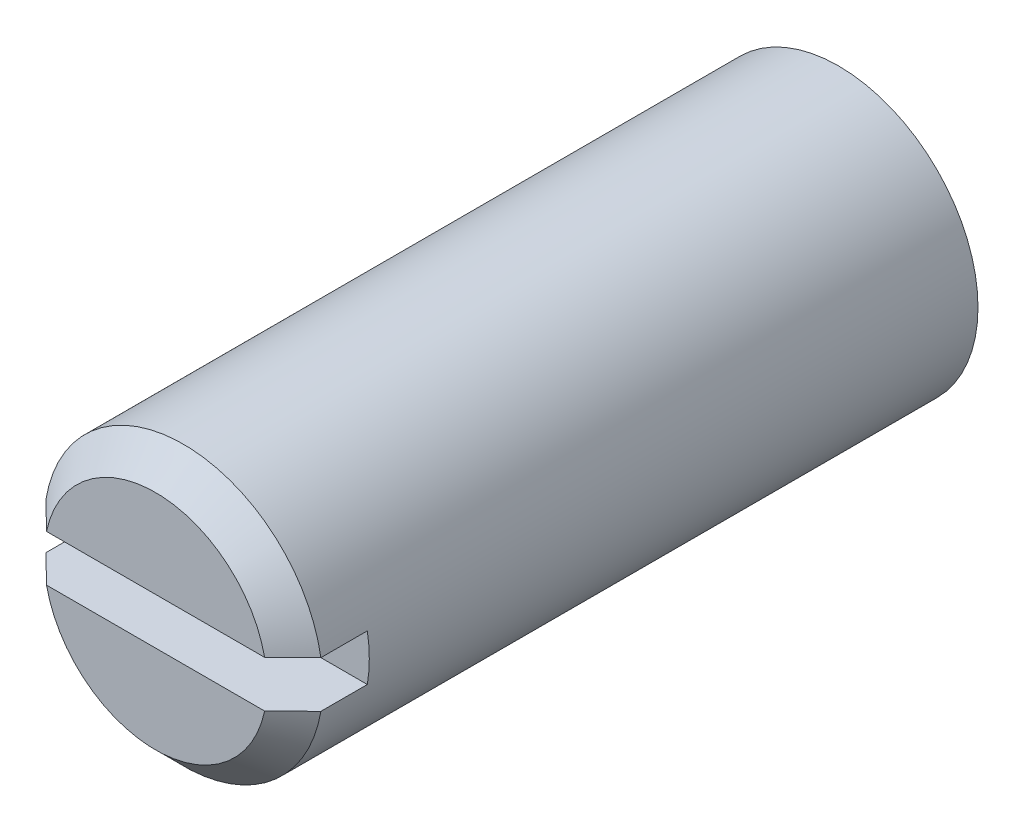
ISO-10303-21;
HEADER;
FILE_DESCRIPTION(('STEP AP214'),'2;1');
FILE_NAME('part.step','',(''),(''),'','','');
FILE_SCHEMA(('AUTOMOTIVE_DESIGN { 1 0 10303 214 1 1 1 1 }'));
ENDSEC;
DATA;
#1=APPLICATION_CONTEXT('core data for automotive mechanical design processes');
#2=APPLICATION_PROTOCOL_DEFINITION('international standard','automotive_design',2000,#1);
#3=PRODUCT_CONTEXT('',#1,'mechanical');
#4=PRODUCT('Part','Part','',(#3));
#5=PRODUCT_RELATED_PRODUCT_CATEGORY('part','',(#4));
#6=PRODUCT_DEFINITION_FORMATION('','',#4);
#7=PRODUCT_DEFINITION_CONTEXT('part definition',#1,'design');
#8=PRODUCT_DEFINITION('design','',#6,#7);
#9=PRODUCT_DEFINITION_SHAPE('','',#8);
#10=(LENGTH_UNIT() NAMED_UNIT(*) SI_UNIT(.MILLI.,.METRE.));
#11=(NAMED_UNIT(*) PLANE_ANGLE_UNIT() SI_UNIT($,.RADIAN.));
#12=(NAMED_UNIT(*) SI_UNIT($,.STERADIAN.) SOLID_ANGLE_UNIT());
#13=UNCERTAINTY_MEASURE_WITH_UNIT(LENGTH_MEASURE(1.E-05),#10,'distance_accuracy_value','');
#14=(GEOMETRIC_REPRESENTATION_CONTEXT(3) GLOBAL_UNCERTAINTY_ASSIGNED_CONTEXT((#13)) GLOBAL_UNIT_ASSIGNED_CONTEXT((#10,
#11,#12)) REPRESENTATION_CONTEXT('',''));
#15=CARTESIAN_POINT('',(0.,0.,0.));
#16=DIRECTION('',(0.,0.,1.));
#17=DIRECTION('',(1.,0.,0.));
#18=AXIS2_PLACEMENT_3D('',#15,#16,#17);
#19=CARTESIAN_POINT('',(0.,0.,0.));
#20=DIRECTION('',(0.,0.,1.));
#21=DIRECTION('',(1.,0.,0.));
#22=AXIS2_PLACEMENT_3D('',#19,#20,#21);
#23=PLANE('',#22);
#24=DIRECTION('',(1.,0.,0.));
#25=VECTOR('',#24,1.);
#26=CARTESIAN_POINT('',(-3.,-0.5,0.));
#27=LINE('',#26,#25);
#28=CARTESIAN_POINT('',(-2.3473389188611,-0.5,0.));
#29=VERTEX_POINT('',#28);
#30=CARTESIAN_POINT('',(2.3473389188611,-0.5,0.));
#31=VERTEX_POINT('',#30);
#32=EDGE_CURVE('E128',#29,#31,#27,.T.);
#33=ORIENTED_EDGE('',*,*,#32,.F.);
#34=CARTESIAN_POINT('',(0.,0.,0.));
#35=DIRECTION('',(0.,0.,1.));
#36=DIRECTION('',(1.,0.,0.));
#37=AXIS2_PLACEMENT_3D('',#34,#35,#36);
#38=CIRCLE('',#37,2.4);
#39=EDGE_CURVE('E173',#29,#31,#38,.T.);
#40=ORIENTED_EDGE('',*,*,#39,.T.);
#41=EDGE_LOOP('',(#33,#40));
#42=FACE_BOUND('',#41,.T.);
#43=ADVANCED_FACE('F35',(#42),#23,.T.);
#44=DIRECTION('',(1.,0.,0.));
#45=VECTOR('',#44,1.);
#46=CARTESIAN_POINT('',(-3.,0.5,0.));
#47=LINE('',#46,#45);
#48=CARTESIAN_POINT('',(-2.3473389188611,0.5,0.));
#49=VERTEX_POINT('',#48);
#50=CARTESIAN_POINT('',(2.3473389188611,0.5,0.));
#51=VERTEX_POINT('',#50);
#52=EDGE_CURVE('E105',#49,#51,#47,.T.);
#53=ORIENTED_EDGE('',*,*,#52,.T.);
#54=CARTESIAN_POINT('',(0.,0.,0.));
#55=DIRECTION('',(0.,0.,1.));
#56=DIRECTION('',(1.,0.,0.));
#57=AXIS2_PLACEMENT_3D('',#54,#55,#56);
#58=CIRCLE('',#57,2.4);
#59=EDGE_CURVE('E11',#51,#49,#58,.T.);
#60=ORIENTED_EDGE('',*,*,#59,.T.);
#61=EDGE_LOOP('',(#53,#60));
#62=FACE_BOUND('',#61,.T.);
#63=ADVANCED_FACE('F183',(#62),#23,.T.);
#64=CARTESIAN_POINT('',(0.,0.,-16.));
#65=DIRECTION('',(0.,0.,-1.));
#66=DIRECTION('',(-1.,0.,0.));
#67=AXIS2_PLACEMENT_3D('',#64,#65,#66);
#68=CYLINDRICAL_SURFACE('',#67,3.);
#69=DIRECTION('',(0.,0.,-1.));
#70=VECTOR('',#69,1.);
#71=CARTESIAN_POINT('',(2.95803989154981,-0.5,-16.));
#72=LINE('',#71,#70);
#73=CARTESIAN_POINT('',(2.95803989154981,-0.5,-0.600000000000002));
#74=VERTEX_POINT('',#73);
#75=CARTESIAN_POINT('',(2.95803989154981,-0.5,-1.6));
#76=VERTEX_POINT('',#75);
#77=EDGE_CURVE('E96',#74,#76,#72,.T.);
#78=ORIENTED_EDGE('',*,*,#77,.F.);
#79=CARTESIAN_POINT('',(0.,0.,-0.600000000000002));
#80=DIRECTION('',(0.,0.,1.));
#81=DIRECTION('',(1.,0.,0.));
#82=AXIS2_PLACEMENT_3D('',#79,#80,#81);
#83=CIRCLE('',#82,3.);
#84=CARTESIAN_POINT('',(-2.95803989154981,-0.5,-0.600000000000002));
#85=VERTEX_POINT('',#84);
#86=EDGE_CURVE('E139',#74,#85,#83,.F.);
#87=ORIENTED_EDGE('',*,*,#86,.T.);
#88=DIRECTION('',(0.,0.,-1.));
#89=VECTOR('',#88,1.);
#90=CARTESIAN_POINT('',(-2.95803989154981,-0.5,-16.));
#91=LINE('',#90,#89);
#92=CARTESIAN_POINT('',(-2.95803989154981,-0.5,-1.6));
#93=VERTEX_POINT('',#92);
#94=EDGE_CURVE('E113',#93,#85,#91,.F.);
#95=ORIENTED_EDGE('',*,*,#94,.F.);
#96=CARTESIAN_POINT('',(0.,0.,-1.6));
#97=DIRECTION('',(0.,0.,-1.));
#98=DIRECTION('',(-1.,0.,0.));
#99=AXIS2_PLACEMENT_3D('',#96,#97,#98);
#100=CIRCLE('',#99,3.);
#101=CARTESIAN_POINT('',(-2.95803989154981,0.5,-1.6));
#102=VERTEX_POINT('',#101);
#103=EDGE_CURVE('E97',#102,#93,#100,.F.);
#104=ORIENTED_EDGE('',*,*,#103,.F.);
#105=DIRECTION('',(0.,0.,-1.));
#106=VECTOR('',#105,1.);
#107=CARTESIAN_POINT('',(-2.95803989154981,0.5,-16.));
#108=LINE('',#107,#106);
#109=CARTESIAN_POINT('',(-2.95803989154981,0.5,-0.600000000000002));
#110=VERTEX_POINT('',#109);
#111=EDGE_CURVE('E85',#110,#102,#108,.T.);
#112=ORIENTED_EDGE('',*,*,#111,.F.);
#113=CARTESIAN_POINT('',(0.,0.,-0.600000000000002));
#114=DIRECTION('',(0.,0.,1.));
#115=DIRECTION('',(1.,0.,0.));
#116=AXIS2_PLACEMENT_3D('',#113,#114,#115);
#117=CIRCLE('',#116,3.);
#118=CARTESIAN_POINT('',(2.95803989154981,0.5,-0.600000000000002));
#119=VERTEX_POINT('',#118);
#120=EDGE_CURVE('E137',#110,#119,#117,.F.);
#121=ORIENTED_EDGE('',*,*,#120,.T.);
#122=DIRECTION('',(0.,0.,-1.));
#123=VECTOR('',#122,1.);
#124=CARTESIAN_POINT('',(2.95803989154981,0.5,-16.));
#125=LINE('',#124,#123);
#126=CARTESIAN_POINT('',(2.95803989154981,0.5,-1.6));
#127=VERTEX_POINT('',#126);
#128=EDGE_CURVE('E114',#127,#119,#125,.F.);
#129=ORIENTED_EDGE('',*,*,#128,.F.);
#130=EDGE_CURVE('E104',#76,#127,#100,.F.);
#131=ORIENTED_EDGE('',*,*,#130,.F.);
#132=EDGE_LOOP('',(#78,#87,#95,#104,#112,#121,#129,#131));
#133=FACE_BOUND('',#132,.T.);
#134=CARTESIAN_POINT('',(0.,0.,-14.7009618943233));
#135=DIRECTION('',(0.,0.,-1.));
#136=DIRECTION('',(-1.,0.,0.));
#137=AXIS2_PLACEMENT_3D('',#134,#135,#136);
#138=CIRCLE('',#137,3.);
#139=CARTESIAN_POINT('',(-3.,0.,-14.7009618943233));
#140=VERTEX_POINT('',#139);
#141=EDGE_CURVE('E118',#140,#140,#138,.T.);
#142=ORIENTED_EDGE('',*,*,#141,.F.);
#143=EDGE_LOOP('',(#142));
#144=FACE_BOUND('',#143,.T.);
#145=ADVANCED_FACE('F109',(#133,#144),#68,.T.);
#146=CARTESIAN_POINT('',(0.,0.,-16.));
#147=DIRECTION('',(0.,0.,1.));
#148=DIRECTION('',(1.,0.,0.));
#149=AXIS2_PLACEMENT_3D('',#146,#147,#148);
#150=CONICAL_SURFACE('',#149,0.75,1.04719755119659);
#151=ORIENTED_EDGE('',*,*,#141,.T.);
#152=EDGE_LOOP('',(#151));
#153=FACE_BOUND('',#152,.T.);
#154=CARTESIAN_POINT('',(0.,0.,-16.));
#155=DIRECTION('',(0.,0.,-1.));
#156=DIRECTION('',(-1.,0.,0.));
#157=AXIS2_PLACEMENT_3D('',#154,#155,#156);
#158=CIRCLE('',#157,0.75);
#159=CARTESIAN_POINT('',(-0.75,0.,-16.));
#160=VERTEX_POINT('',#159);
#161=EDGE_CURVE('E120',#160,#160,#158,.T.);
#162=ORIENTED_EDGE('',*,*,#161,.F.);
#163=EDGE_LOOP('',(#162));
#164=FACE_BOUND('',#163,.T.);
#165=ADVANCED_FACE('F190',(#153,#164),#150,.T.);
#166=CARTESIAN_POINT('',(-0.75,0.,-16.));
#167=DIRECTION('',(0.,0.,-1.));
#168=DIRECTION('',(-1.,0.,0.));
#169=AXIS2_PLACEMENT_3D('',#166,#167,#168);
#170=PLANE('',#169);
#171=ORIENTED_EDGE('',*,*,#161,.T.);
#172=EDGE_LOOP('',(#171));
#173=FACE_BOUND('',#172,.T.);
#174=ADVANCED_FACE('F192',(#173),#170,.T.);
#175=CARTESIAN_POINT('',(-3.,0.5,-1.6));
#176=DIRECTION('',(0.,0.,-1.));
#177=DIRECTION('',(-1.,0.,0.));
#178=AXIS2_PLACEMENT_3D('',#175,#176,#177);
#179=PLANE('',#178);
#180=DIRECTION('',(1.,0.,0.));
#181=VECTOR('',#180,1.);
#182=CARTESIAN_POINT('',(-3.,-0.5,-1.6));
#183=LINE('',#182,#181);
#184=EDGE_CURVE('E124',#93,#76,#183,.T.);
#185=ORIENTED_EDGE('',*,*,#184,.T.);
#186=ORIENTED_EDGE('',*,*,#130,.T.);
#187=DIRECTION('',(1.,0.,0.));
#188=VECTOR('',#187,1.);
#189=CARTESIAN_POINT('',(-3.,0.5,-1.6));
#190=LINE('',#189,#188);
#191=EDGE_CURVE('E88',#102,#127,#190,.T.);
#192=ORIENTED_EDGE('',*,*,#191,.F.);
#193=ORIENTED_EDGE('',*,*,#103,.T.);
#194=EDGE_LOOP('',(#185,#186,#192,#193));
#195=FACE_BOUND('',#194,.T.);
#196=ADVANCED_FACE('F101',(#195),#179,.F.);
#197=CARTESIAN_POINT('',(-3.,-0.5,0.));
#198=DIRECTION('',(0.,-1.,0.));
#199=DIRECTION('',(0.,0.,-1.));
#200=AXIS2_PLACEMENT_3D('',#197,#198,#199);
#201=PLANE('',#200);
#202=ORIENTED_EDGE('',*,*,#94,.T.);
#203=CARTESIAN_POINT('',(-2.95803989154981,-0.5,-0.600000000000001));
#204=CARTESIAN_POINT('',(-2.85645630983513,-0.5,-0.499796543419295));
#205=CARTESIAN_POINT('',(-2.75477277691521,-0.5,-0.399694820669012));
#206=CARTESIAN_POINT('',(-2.55120578606336,-0.5,-0.19969482062383));
#207=CARTESIAN_POINT('',(-2.44932232808705,-0.5,-0.0997965433741128));
#208=CARTESIAN_POINT('',(-2.3473389188611,-0.5,0.));
#209=B_SPLINE_CURVE_WITH_KNOTS('',3,(#203,#204,#205,#206,#207,#208),.UNSPECIFIED.,.F.,.F.,(4,2,
4),(0.,0.428064319795366,0.856128734644404),.UNSPECIFIED.);
#210=EDGE_CURVE('E149',#85,#29,#209,.T.);
#211=ORIENTED_EDGE('',*,*,#210,.T.);
#212=ORIENTED_EDGE('',*,*,#32,.T.);
#213=CARTESIAN_POINT('',(2.3473389188611,-0.5,0.));
#214=CARTESIAN_POINT('',(2.44932232808705,-0.5,-0.0997965433741128));
#215=CARTESIAN_POINT('',(2.55120578606336,-0.5,-0.19969482062383));
#216=CARTESIAN_POINT('',(2.75477277691521,-0.5,-0.399694820669012));
#217=CARTESIAN_POINT('',(2.85645630983513,-0.5,-0.499796543419295));
#218=CARTESIAN_POINT('',(2.95803989154981,-0.5,-0.600000000000001));
#219=B_SPLINE_CURVE_WITH_KNOTS('',3,(#213,#214,#215,#216,#217,#218),.UNSPECIFIED.,.F.,.F.,(4,2,
4),(0.,0.428064414849038,0.856128734644404),.UNSPECIFIED.);
#220=EDGE_CURVE('E134',#31,#74,#219,.T.);
#221=ORIENTED_EDGE('',*,*,#220,.T.);
#222=ORIENTED_EDGE('',*,*,#77,.T.);
#223=ORIENTED_EDGE('',*,*,#184,.F.);
#224=EDGE_LOOP('',(#202,#211,#212,#221,#222,#223));
#225=FACE_BOUND('',#224,.T.);
#226=ADVANCED_FACE('F132',(#225),#201,.F.);
#227=CARTESIAN_POINT('',(-3.,0.5,0.));
#228=DIRECTION('',(0.,1.,0.));
#229=DIRECTION('',(0.,0.,1.));
#230=AXIS2_PLACEMENT_3D('',#227,#228,#229);
#231=PLANE('',#230);
#232=ORIENTED_EDGE('',*,*,#128,.T.);
#233=CARTESIAN_POINT('',(2.95803989154981,0.5,-0.600000000000001));
#234=CARTESIAN_POINT('',(2.85645630983513,0.5,-0.499796543419295));
#235=CARTESIAN_POINT('',(2.75477277691521,0.5,-0.399694820669012));
#236=CARTESIAN_POINT('',(2.55120578606336,0.5,-0.19969482062383));
#237=CARTESIAN_POINT('',(2.44932232808705,0.5,-0.0997965433741128));
#238=CARTESIAN_POINT('',(2.3473389188611,0.5,0.));
#239=B_SPLINE_CURVE_WITH_KNOTS('',3,(#233,#234,#235,#236,#237,#238),.UNSPECIFIED.,.F.,.F.,(4,2,
4),(0.,0.428064319795366,0.856128734644404),.UNSPECIFIED.);
#240=EDGE_CURVE('E44',#119,#51,#239,.T.);
#241=ORIENTED_EDGE('',*,*,#240,.T.);
#242=ORIENTED_EDGE('',*,*,#52,.F.);
#243=CARTESIAN_POINT('',(-2.3473389188611,0.5,0.));
#244=CARTESIAN_POINT('',(-2.44932232808705,0.5,-0.0997965433741127));
#245=CARTESIAN_POINT('',(-2.55120578606336,0.5,-0.19969482062383));
#246=CARTESIAN_POINT('',(-2.75477277691521,0.5,-0.399694820669012));
#247=CARTESIAN_POINT('',(-2.85645630983513,0.5,-0.499796543419295));
#248=CARTESIAN_POINT('',(-2.95803989154981,0.5,-0.600000000000001));
#249=B_SPLINE_CURVE_WITH_KNOTS('',3,(#243,#244,#245,#246,#247,#248),.UNSPECIFIED.,.F.,.F.,(4,2,
4),(0.,0.428064414849038,0.856128734644404),.UNSPECIFIED.);
#250=EDGE_CURVE('E91',#49,#110,#249,.T.);
#251=ORIENTED_EDGE('',*,*,#250,.T.);
#252=ORIENTED_EDGE('',*,*,#111,.T.);
#253=ORIENTED_EDGE('',*,*,#191,.T.);
#254=EDGE_LOOP('',(#232,#241,#242,#251,#252,#253));
#255=FACE_BOUND('',#254,.T.);
#256=ADVANCED_FACE('F87',(#255),#231,.F.);
#257=CARTESIAN_POINT('',(0.,0.,-0.600000000000002));
#258=DIRECTION('',(0.,0.,-1.));
#259=DIRECTION('',(-1.,0.,0.));
#260=AXIS2_PLACEMENT_3D('',#257,#258,#259);
#261=CONICAL_SURFACE('',#260,3.,0.785398163397449);
#262=ORIENTED_EDGE('',*,*,#220,.F.);
#263=ORIENTED_EDGE('',*,*,#39,.F.);
#264=ORIENTED_EDGE('',*,*,#210,.F.);
#265=ORIENTED_EDGE('',*,*,#86,.F.);
#266=EDGE_LOOP('',(#262,#263,#264,#265));
#267=FACE_BOUND('',#266,.T.);
#268=ADVANCED_FACE('F154',(#267),#261,.T.);
#269=CARTESIAN_POINT('',(0.,0.,-0.600000000000002));
#270=DIRECTION('',(0.,0.,-1.));
#271=DIRECTION('',(-1.,0.,0.));
#272=AXIS2_PLACEMENT_3D('',#269,#270,#271);
#273=CONICAL_SURFACE('',#272,3.,0.785398163397449);
#274=ORIENTED_EDGE('',*,*,#250,.F.);
#275=ORIENTED_EDGE('',*,*,#59,.F.);
#276=ORIENTED_EDGE('',*,*,#240,.F.);
#277=ORIENTED_EDGE('',*,*,#120,.F.);
#278=EDGE_LOOP('',(#274,#275,#276,#277));
#279=FACE_BOUND('',#278,.T.);
#280=ADVANCED_FACE('F37',(#279),#273,.T.);
#281=CLOSED_SHELL('',(#43,#63,#145,#165,#174,#196,#226,#256,#268,#280));
#282=MANIFOLD_SOLID_BREP('B2',#281);
#283=ADVANCED_BREP_SHAPE_REPRESENTATION('',(#18,#282),#14);
#284=SHAPE_DEFINITION_REPRESENTATION(#9,#283);
ENDSEC;
END-ISO-10303-21;
